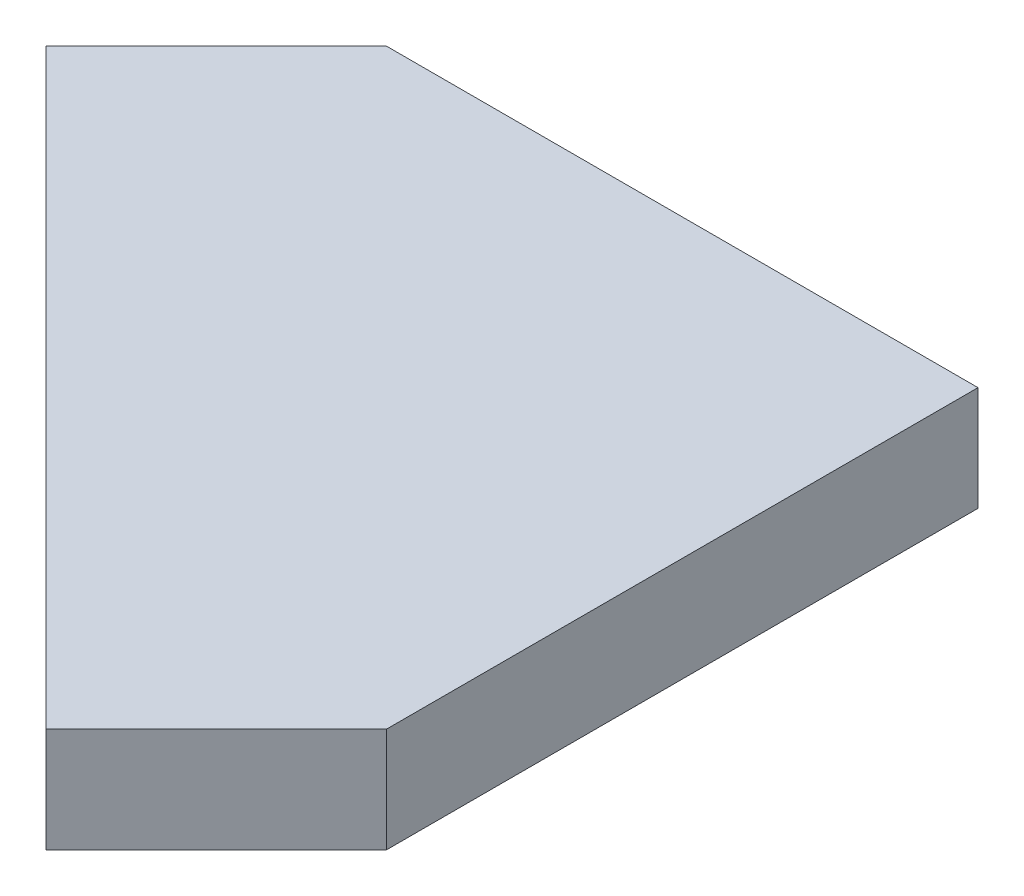
ISO-10303-21;
HEADER;
FILE_DESCRIPTION(('STEP AP214'),'2;1');
FILE_NAME('part.step','',(''),(''),'','','');
FILE_SCHEMA(('AUTOMOTIVE_DESIGN { 1 0 10303 214 1 1 1 1 }'));
ENDSEC;
DATA;
#1=APPLICATION_CONTEXT('core data for automotive mechanical design processes');
#2=APPLICATION_PROTOCOL_DEFINITION('international standard','automotive_design',2000,#1);
#3=PRODUCT_CONTEXT('',#1,'mechanical');
#4=PRODUCT('Part','Part','',(#3));
#5=PRODUCT_RELATED_PRODUCT_CATEGORY('part','',(#4));
#6=PRODUCT_DEFINITION_FORMATION('','',#4);
#7=PRODUCT_DEFINITION_CONTEXT('part definition',#1,'design');
#8=PRODUCT_DEFINITION('design','',#6,#7);
#9=PRODUCT_DEFINITION_SHAPE('','',#8);
#10=(LENGTH_UNIT() NAMED_UNIT(*) SI_UNIT(.MILLI.,.METRE.));
#11=(NAMED_UNIT(*) PLANE_ANGLE_UNIT() SI_UNIT($,.RADIAN.));
#12=(NAMED_UNIT(*) SI_UNIT($,.STERADIAN.) SOLID_ANGLE_UNIT());
#13=UNCERTAINTY_MEASURE_WITH_UNIT(LENGTH_MEASURE(1.E-05),#10,'distance_accuracy_value','');
#14=(GEOMETRIC_REPRESENTATION_CONTEXT(3) GLOBAL_UNCERTAINTY_ASSIGNED_CONTEXT((#13)) GLOBAL_UNIT_ASSIGNED_CONTEXT((#10,
#11,#12)) REPRESENTATION_CONTEXT('',''));
#15=CARTESIAN_POINT('',(0.,0.,0.));
#16=DIRECTION('',(0.,0.,1.));
#17=DIRECTION('',(1.,0.,0.));
#18=AXIS2_PLACEMENT_3D('',#15,#16,#17);
#19=CARTESIAN_POINT('',(0.,0.2,0.));
#20=DIRECTION('',(0.,1.,0.));
#21=DIRECTION('',(-1.,0.,0.));
#22=AXIS2_PLACEMENT_3D('',#19,#20,#21);
#23=PLANE('',#22);
#24=DIRECTION('',(-0.707106781186547,0.,-0.707106781186548));
#25=VECTOR('',#24,1.);
#26=CARTESIAN_POINT('',(3.9242640687119,0.200000000000009,-2.79289321881347));
#27=LINE('',#26,#25);
#28=CARTESIAN_POINT('',(3.9242640687119,0.20000000000001,-2.79289321881347));
#29=VERTEX_POINT('',#28);
#30=CARTESIAN_POINT('',(2.79289321881342,0.200000000000014,-3.92426406871195));
#31=VERTEX_POINT('',#30);
#32=EDGE_CURVE('E11',#29,#31,#27,.T.);
#33=ORIENTED_EDGE('',*,*,#32,.F.);
#34=DIRECTION('',(-0.707106781186548,0.,0.707106781186548));
#35=VECTOR('',#34,1.);
#36=CARTESIAN_POINT('',(4.24999999999998,0.200000000000011,-3.11862915010155));
#37=LINE('',#36,#35);
#38=CARTESIAN_POINT('',(4.24999999999998,0.200000000000011,-3.11862915010153));
#39=VERTEX_POINT('',#38);
#40=EDGE_CURVE('E24',#39,#29,#37,.T.);
#41=ORIENTED_EDGE('',*,*,#40,.F.);
#42=DIRECTION('',(0.,0.,1.));
#43=VECTOR('',#42,1.);
#44=CARTESIAN_POINT('',(4.24999999999998,0.200000000000014,-4.25000000000002));
#45=LINE('',#44,#43);
#46=CARTESIAN_POINT('',(4.24999999999998,0.200000000000014,-4.25000000000002));
#47=VERTEX_POINT('',#46);
#48=EDGE_CURVE('E81',#47,#39,#45,.T.);
#49=ORIENTED_EDGE('',*,*,#48,.F.);
#50=DIRECTION('',(1.,0.,0.));
#51=VECTOR('',#50,1.);
#52=CARTESIAN_POINT('',(3.11862915010149,0.200000000000014,-4.25000000000002));
#53=LINE('',#52,#51);
#54=CARTESIAN_POINT('',(3.11862915010149,0.200000000000014,-4.25000000000002));
#55=VERTEX_POINT('',#54);
#56=EDGE_CURVE('E99',#55,#47,#53,.T.);
#57=ORIENTED_EDGE('',*,*,#56,.F.);
#58=DIRECTION('',(0.707106781186549,0.,-0.707106781186546));
#59=VECTOR('',#58,1.);
#60=CARTESIAN_POINT('',(2.79289321881342,0.200000000000014,-3.92426406871195));
#61=LINE('',#60,#59);
#62=EDGE_CURVE('E96',#31,#55,#61,.T.);
#63=ORIENTED_EDGE('',*,*,#62,.F.);
#64=EDGE_LOOP('',(#33,#41,#49,#57,#63));
#65=FACE_BOUND('',#64,.T.);
#66=ADVANCED_FACE('F17',(#65),#23,.T.);
#67=CARTESIAN_POINT('',(0.,0.,0.));
#68=DIRECTION('',(0.,-1.,0.));
#69=DIRECTION('',(0.,0.,-1.));
#70=AXIS2_PLACEMENT_3D('',#67,#68,#69);
#71=PLANE('',#70);
#72=DIRECTION('',(-0.707106781186547,0.,-0.707106781186548));
#73=VECTOR('',#72,1.);
#74=CARTESIAN_POINT('',(3.9242640687119,0.,-2.79289321881347));
#75=LINE('',#74,#73);
#76=CARTESIAN_POINT('',(3.9242640687119,0.,-2.79289321881347));
#77=VERTEX_POINT('',#76);
#78=CARTESIAN_POINT('',(2.79289321881342,0.,-3.92426406871195));
#79=VERTEX_POINT('',#78);
#80=EDGE_CURVE('E94',#77,#79,#75,.T.);
#81=ORIENTED_EDGE('',*,*,#80,.T.);
#82=DIRECTION('',(0.707106781186549,0.,-0.707106781186546));
#83=VECTOR('',#82,1.);
#84=CARTESIAN_POINT('',(2.79289321881342,0.,-3.92426406871195));
#85=LINE('',#84,#83);
#86=CARTESIAN_POINT('',(3.11862915010149,0.,-4.25000000000002));
#87=VERTEX_POINT('',#86);
#88=EDGE_CURVE('E92',#79,#87,#85,.T.);
#89=ORIENTED_EDGE('',*,*,#88,.T.);
#90=DIRECTION('',(1.,0.,0.));
#91=VECTOR('',#90,1.);
#92=CARTESIAN_POINT('',(3.11862915010149,0.,-4.25000000000002));
#93=LINE('',#92,#91);
#94=CARTESIAN_POINT('',(4.24999999999998,0.,-4.25000000000002));
#95=VERTEX_POINT('',#94);
#96=EDGE_CURVE('E66',#87,#95,#93,.T.);
#97=ORIENTED_EDGE('',*,*,#96,.T.);
#98=DIRECTION('',(0.,0.,1.));
#99=VECTOR('',#98,1.);
#100=CARTESIAN_POINT('',(4.24999999999998,0.,-4.25000000000002));
#101=LINE('',#100,#99);
#102=CARTESIAN_POINT('',(4.24999999999998,0.,-3.11862915010155));
#103=VERTEX_POINT('',#102);
#104=EDGE_CURVE('E60',#95,#103,#101,.T.);
#105=ORIENTED_EDGE('',*,*,#104,.T.);
#106=DIRECTION('',(-0.707106781186548,0.,0.707106781186548));
#107=VECTOR('',#106,1.);
#108=CARTESIAN_POINT('',(4.24999999999998,0.,-3.11862915010155));
#109=LINE('',#108,#107);
#110=EDGE_CURVE('E63',#103,#77,#109,.T.);
#111=ORIENTED_EDGE('',*,*,#110,.T.);
#112=EDGE_LOOP('',(#81,#89,#97,#105,#111));
#113=FACE_BOUND('',#112,.T.);
#114=ADVANCED_FACE('F62',(#113),#71,.T.);
#115=CARTESIAN_POINT('',(2.79289321881342,4.22492235949964,-3.92426406871194));
#116=DIRECTION('',(-0.707106781186546,0.,-0.707106781186549));
#117=DIRECTION('',(-0.707106781186549,0.,0.707106781186546));
#118=AXIS2_PLACEMENT_3D('',#115,#116,#117);
#119=PLANE('',#118);
#120=DIRECTION('',(0.,-1.,0.));
#121=VECTOR('',#120,1.);
#122=CARTESIAN_POINT('',(2.79289321881342,4.22492235949964,-3.92426406871194));
#123=LINE('',#122,#121);
#124=EDGE_CURVE('E77',#31,#79,#123,.T.);
#125=ORIENTED_EDGE('',*,*,#124,.F.);
#126=ORIENTED_EDGE('',*,*,#62,.T.);
#127=DIRECTION('',(0.,-1.,0.));
#128=VECTOR('',#127,1.);
#129=CARTESIAN_POINT('',(3.11862915010149,4.22492235949964,-4.25000000000001));
#130=LINE('',#129,#128);
#131=EDGE_CURVE('E84',#55,#87,#130,.T.);
#132=ORIENTED_EDGE('',*,*,#131,.T.);
#133=ORIENTED_EDGE('',*,*,#88,.F.);
#134=EDGE_LOOP('',(#125,#126,#132,#133));
#135=FACE_BOUND('',#134,.T.);
#136=ADVANCED_FACE('F106',(#135),#119,.T.);
#137=CARTESIAN_POINT('',(3.11862915010149,4.22492235949964,-4.25000000000001));
#138=DIRECTION('',(0.,0.,-1.));
#139=DIRECTION('',(0.,1.,0.));
#140=AXIS2_PLACEMENT_3D('',#137,#138,#139);
#141=PLANE('',#140);
#142=ORIENTED_EDGE('',*,*,#131,.F.);
#143=ORIENTED_EDGE('',*,*,#56,.T.);
#144=DIRECTION('',(0.,-1.,0.));
#145=VECTOR('',#144,1.);
#146=CARTESIAN_POINT('',(4.24999999999998,4.22492235949964,-4.25000000000001));
#147=LINE('',#146,#145);
#148=EDGE_CURVE('E82',#47,#95,#147,.T.);
#149=ORIENTED_EDGE('',*,*,#148,.T.);
#150=ORIENTED_EDGE('',*,*,#96,.F.);
#151=EDGE_LOOP('',(#142,#143,#149,#150));
#152=FACE_BOUND('',#151,.T.);
#153=ADVANCED_FACE('F109',(#152),#141,.T.);
#154=CARTESIAN_POINT('',(4.24999999999998,4.22492235949964,-4.25000000000001));
#155=DIRECTION('',(1.,0.,0.));
#156=DIRECTION('',(0.,1.,0.));
#157=AXIS2_PLACEMENT_3D('',#154,#155,#156);
#158=PLANE('',#157);
#159=ORIENTED_EDGE('',*,*,#148,.F.);
#160=ORIENTED_EDGE('',*,*,#48,.T.);
#161=DIRECTION('',(0.,-1.,0.));
#162=VECTOR('',#161,1.);
#163=CARTESIAN_POINT('',(4.24999999999998,4.22492235949963,-3.11862915010153));
#164=LINE('',#163,#162);
#165=EDGE_CURVE('E75',#39,#103,#164,.T.);
#166=ORIENTED_EDGE('',*,*,#165,.T.);
#167=ORIENTED_EDGE('',*,*,#104,.F.);
#168=EDGE_LOOP('',(#159,#160,#166,#167));
#169=FACE_BOUND('',#168,.T.);
#170=ADVANCED_FACE('F80',(#169),#158,.T.);
#171=CARTESIAN_POINT('',(4.24999999999998,4.22492235949963,-3.11862915010153));
#172=DIRECTION('',(0.707106781186548,0.,0.707106781186548));
#173=DIRECTION('',(0.707106781186548,0.,-0.707106781186548));
#174=AXIS2_PLACEMENT_3D('',#171,#172,#173);
#175=PLANE('',#174);
#176=ORIENTED_EDGE('',*,*,#165,.F.);
#177=ORIENTED_EDGE('',*,*,#40,.T.);
#178=DIRECTION('',(0.,-1.,0.));
#179=VECTOR('',#178,1.);
#180=CARTESIAN_POINT('',(3.9242640687119,4.22492235949963,-2.79289321881346));
#181=LINE('',#180,#179);
#182=EDGE_CURVE('E76',#29,#77,#181,.T.);
#183=ORIENTED_EDGE('',*,*,#182,.T.);
#184=ORIENTED_EDGE('',*,*,#110,.F.);
#185=EDGE_LOOP('',(#176,#177,#183,#184));
#186=FACE_BOUND('',#185,.T.);
#187=ADVANCED_FACE('F74',(#186),#175,.T.);
#188=CARTESIAN_POINT('',(3.9242640687119,4.22492235949963,-2.79289321881346));
#189=DIRECTION('',(-0.707106781186548,0.,0.707106781186547));
#190=DIRECTION('',(0.707106781186547,0.,0.707106781186548));
#191=AXIS2_PLACEMENT_3D('',#188,#189,#190);
#192=PLANE('',#191);
#193=ORIENTED_EDGE('',*,*,#182,.F.);
#194=ORIENTED_EDGE('',*,*,#32,.T.);
#195=ORIENTED_EDGE('',*,*,#124,.T.);
#196=ORIENTED_EDGE('',*,*,#80,.F.);
#197=EDGE_LOOP('',(#193,#194,#195,#196));
#198=FACE_BOUND('',#197,.T.);
#199=ADVANCED_FACE('F102',(#198),#192,.T.);
#200=CLOSED_SHELL('',(#66,#114,#136,#153,#170,#187,#199));
#201=MANIFOLD_SOLID_BREP('B1',#200);
#202=ADVANCED_BREP_SHAPE_REPRESENTATION('',(#18,#201),#14);
#203=SHAPE_DEFINITION_REPRESENTATION(#9,#202);
ENDSEC;
END-ISO-10303-21;
